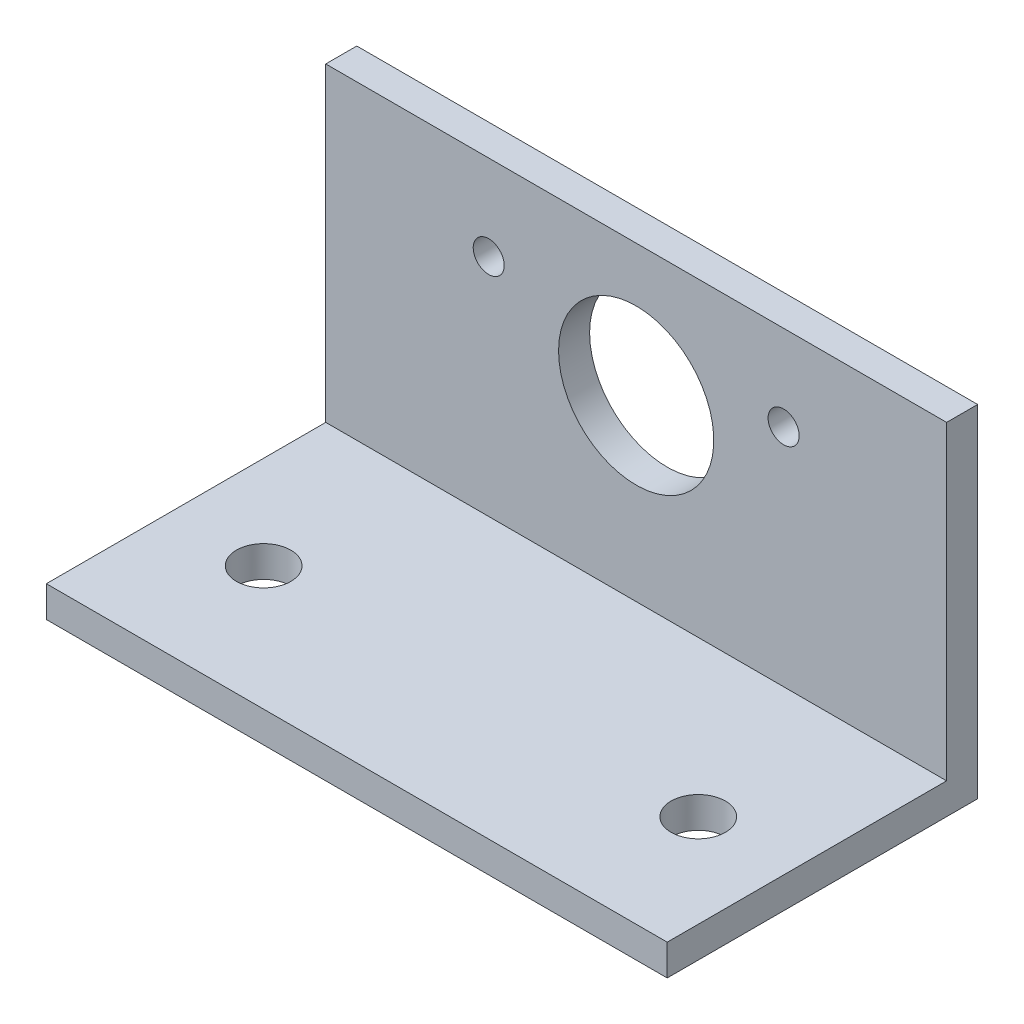
ISO-10303-21;
HEADER;
FILE_DESCRIPTION(('STEP AP214'),'2;1');
FILE_NAME('part.step','',(''),(''),'','','');
FILE_SCHEMA(('AUTOMOTIVE_DESIGN { 1 0 10303 214 1 1 1 1 }'));
ENDSEC;
DATA;
#1=APPLICATION_CONTEXT('core data for automotive mechanical design processes');
#2=APPLICATION_PROTOCOL_DEFINITION('international standard','automotive_design',2000,#1);
#3=PRODUCT_CONTEXT('',#1,'mechanical');
#4=PRODUCT('Part','Part','',(#3));
#5=PRODUCT_RELATED_PRODUCT_CATEGORY('part','',(#4));
#6=PRODUCT_DEFINITION_FORMATION('','',#4);
#7=PRODUCT_DEFINITION_CONTEXT('part definition',#1,'design');
#8=PRODUCT_DEFINITION('design','',#6,#7);
#9=PRODUCT_DEFINITION_SHAPE('','',#8);
#10=(LENGTH_UNIT() NAMED_UNIT(*) SI_UNIT(.MILLI.,.METRE.));
#11=(NAMED_UNIT(*) PLANE_ANGLE_UNIT() SI_UNIT($,.RADIAN.));
#12=(NAMED_UNIT(*) SI_UNIT($,.STERADIAN.) SOLID_ANGLE_UNIT());
#13=UNCERTAINTY_MEASURE_WITH_UNIT(LENGTH_MEASURE(1.E-05),#10,'distance_accuracy_value','');
#14=(GEOMETRIC_REPRESENTATION_CONTEXT(3) GLOBAL_UNCERTAINTY_ASSIGNED_CONTEXT((#13)) GLOBAL_UNIT_ASSIGNED_CONTEXT((#10,
#11,#12)) REPRESENTATION_CONTEXT('',''));
#15=CARTESIAN_POINT('',(0.,0.,0.));
#16=DIRECTION('',(0.,0.,1.));
#17=DIRECTION('',(1.,0.,0.));
#18=AXIS2_PLACEMENT_3D('',#15,#16,#17);
#19=CARTESIAN_POINT('',(20.,2.,-10.));
#20=DIRECTION('',(-1.,0.,0.));
#21=DIRECTION('',(0.,0.,1.));
#22=AXIS2_PLACEMENT_3D('',#19,#20,#21);
#23=PLANE('',#22);
#24=DIRECTION('',(0.,0.,-1.));
#25=VECTOR('',#24,1.);
#26=CARTESIAN_POINT('',(20.,0.,-10.));
#27=LINE('',#26,#25);
#28=CARTESIAN_POINT('',(20.,0.,10.));
#29=VERTEX_POINT('',#28);
#30=CARTESIAN_POINT('',(20.,0.,-10.));
#31=VERTEX_POINT('',#30);
#32=EDGE_CURVE('E102',#29,#31,#27,.T.);
#33=ORIENTED_EDGE('',*,*,#32,.T.);
#34=DIRECTION('',(0.,-1.,0.));
#35=VECTOR('',#34,1.);
#36=CARTESIAN_POINT('',(20.,2.,-10.));
#37=LINE('',#36,#35);
#38=CARTESIAN_POINT('',(20.,22.,-10.));
#39=VERTEX_POINT('',#38);
#40=EDGE_CURVE('E11',#39,#31,#37,.T.);
#41=ORIENTED_EDGE('',*,*,#40,.F.);
#42=DIRECTION('',(0.,0.,-1.));
#43=VECTOR('',#42,1.);
#44=CARTESIAN_POINT('',(20.,22.,-10.));
#45=LINE('',#44,#43);
#46=CARTESIAN_POINT('',(20.,22.,-8.));
#47=VERTEX_POINT('',#46);
#48=EDGE_CURVE('E168',#47,#39,#45,.T.);
#49=ORIENTED_EDGE('',*,*,#48,.F.);
#50=DIRECTION('',(0.,-1.,0.));
#51=VECTOR('',#50,1.);
#52=CARTESIAN_POINT('',(20.,22.,-8.));
#53=LINE('',#52,#51);
#54=CARTESIAN_POINT('',(20.,2.,-8.));
#55=VERTEX_POINT('',#54);
#56=EDGE_CURVE('E115',#47,#55,#53,.T.);
#57=ORIENTED_EDGE('',*,*,#56,.T.);
#58=DIRECTION('',(0.,0.,-1.));
#59=VECTOR('',#58,1.);
#60=CARTESIAN_POINT('',(20.,2.,-10.));
#61=LINE('',#60,#59);
#62=CARTESIAN_POINT('',(20.,2.,10.));
#63=VERTEX_POINT('',#62);
#64=EDGE_CURVE('E96',#63,#55,#61,.T.);
#65=ORIENTED_EDGE('',*,*,#64,.F.);
#66=DIRECTION('',(0.,-1.,0.));
#67=VECTOR('',#66,1.);
#68=CARTESIAN_POINT('',(20.,2.,10.));
#69=LINE('',#68,#67);
#70=EDGE_CURVE('E88',#63,#29,#69,.T.);
#71=ORIENTED_EDGE('',*,*,#70,.T.);
#72=EDGE_LOOP('',(#33,#41,#49,#57,#65,#71));
#73=FACE_BOUND('',#72,.T.);
#74=ADVANCED_FACE('F43',(#73),#23,.F.);
#75=CARTESIAN_POINT('',(-20.,2.,-10.));
#76=DIRECTION('',(0.,0.,1.));
#77=DIRECTION('',(1.,0.,0.));
#78=AXIS2_PLACEMENT_3D('',#75,#76,#77);
#79=PLANE('',#78);
#80=CARTESIAN_POINT('',(-9.5,16.5,-10.));
#81=DIRECTION('',(0.,0.,-1.));
#82=DIRECTION('',(-1.,0.,0.));
#83=AXIS2_PLACEMENT_3D('',#80,#81,#82);
#84=CIRCLE('',#83,1.);
#85=CARTESIAN_POINT('',(-10.5,16.5,-10.));
#86=VERTEX_POINT('',#85);
#87=EDGE_CURVE('E267',#86,#86,#84,.T.);
#88=ORIENTED_EDGE('',*,*,#87,.F.);
#89=EDGE_LOOP('',(#88));
#90=FACE_BOUND('',#89,.T.);
#91=CARTESIAN_POINT('',(9.5,16.5,-10.));
#92=DIRECTION('',(0.,0.,-1.));
#93=DIRECTION('',(-1.,0.,0.));
#94=AXIS2_PLACEMENT_3D('',#91,#92,#93);
#95=CIRCLE('',#94,1.);
#96=CARTESIAN_POINT('',(8.5,16.5,-10.));
#97=VERTEX_POINT('',#96);
#98=EDGE_CURVE('E265',#97,#97,#95,.T.);
#99=ORIENTED_EDGE('',*,*,#98,.F.);
#100=EDGE_LOOP('',(#99));
#101=FACE_BOUND('',#100,.T.);
#102=CARTESIAN_POINT('',(0.,13.5,-10.));
#103=DIRECTION('',(0.,0.,-1.));
#104=DIRECTION('',(-1.,0.,0.));
#105=AXIS2_PLACEMENT_3D('',#102,#103,#104);
#106=CIRCLE('',#105,5.);
#107=CARTESIAN_POINT('',(-5.,13.5,-10.));
#108=VERTEX_POINT('',#107);
#109=EDGE_CURVE('E131',#108,#108,#106,.T.);
#110=ORIENTED_EDGE('',*,*,#109,.F.);
#111=EDGE_LOOP('',(#110));
#112=FACE_BOUND('',#111,.T.);
#113=DIRECTION('',(-1.,0.,0.));
#114=VECTOR('',#113,1.);
#115=CARTESIAN_POINT('',(-20.,0.,-10.));
#116=LINE('',#115,#114);
#117=CARTESIAN_POINT('',(-20.,0.,-10.));
#118=VERTEX_POINT('',#117);
#119=EDGE_CURVE('E107',#31,#118,#116,.T.);
#120=ORIENTED_EDGE('',*,*,#119,.T.);
#121=DIRECTION('',(0.,-1.,0.));
#122=VECTOR('',#121,1.);
#123=CARTESIAN_POINT('',(-20.,2.,-10.));
#124=LINE('',#123,#122);
#125=CARTESIAN_POINT('',(-20.,22.,-10.));
#126=VERTEX_POINT('',#125);
#127=EDGE_CURVE('E52',#126,#118,#124,.T.);
#128=ORIENTED_EDGE('',*,*,#127,.F.);
#129=DIRECTION('',(-1.,0.,0.));
#130=VECTOR('',#129,1.);
#131=CARTESIAN_POINT('',(-20.,22.,-10.));
#132=LINE('',#131,#130);
#133=EDGE_CURVE('E172',#39,#126,#132,.T.);
#134=ORIENTED_EDGE('',*,*,#133,.F.);
#135=ORIENTED_EDGE('',*,*,#40,.T.);
#136=EDGE_LOOP('',(#120,#128,#134,#135));
#137=FACE_BOUND('',#136,.T.);
#138=ADVANCED_FACE('F192',(#90,#101,#112,#137),#79,.F.);
#139=CARTESIAN_POINT('',(-20.,2.,-10.));
#140=DIRECTION('',(1.,0.,0.));
#141=DIRECTION('',(0.,0.,-1.));
#142=AXIS2_PLACEMENT_3D('',#139,#140,#141);
#143=PLANE('',#142);
#144=DIRECTION('',(0.,0.,1.));
#145=VECTOR('',#144,1.);
#146=CARTESIAN_POINT('',(-20.,0.,-10.));
#147=LINE('',#146,#145);
#148=CARTESIAN_POINT('',(-20.,0.,10.));
#149=VERTEX_POINT('',#148);
#150=EDGE_CURVE('E97',#118,#149,#147,.T.);
#151=ORIENTED_EDGE('',*,*,#150,.T.);
#152=DIRECTION('',(0.,-1.,0.));
#153=VECTOR('',#152,1.);
#154=CARTESIAN_POINT('',(-20.,2.,10.));
#155=LINE('',#154,#153);
#156=CARTESIAN_POINT('',(-20.,2.,10.));
#157=VERTEX_POINT('',#156);
#158=EDGE_CURVE('E91',#157,#149,#155,.T.);
#159=ORIENTED_EDGE('',*,*,#158,.F.);
#160=DIRECTION('',(0.,0.,1.));
#161=VECTOR('',#160,1.);
#162=CARTESIAN_POINT('',(-20.,2.,-10.));
#163=LINE('',#162,#161);
#164=CARTESIAN_POINT('',(-20.,2.,-8.));
#165=VERTEX_POINT('',#164);
#166=EDGE_CURVE('E181',#165,#157,#163,.T.);
#167=ORIENTED_EDGE('',*,*,#166,.F.);
#168=DIRECTION('',(0.,-1.,0.));
#169=VECTOR('',#168,1.);
#170=CARTESIAN_POINT('',(-20.,22.,-8.));
#171=LINE('',#170,#169);
#172=CARTESIAN_POINT('',(-20.,22.,-8.));
#173=VERTEX_POINT('',#172);
#174=EDGE_CURVE('E109',#173,#165,#171,.T.);
#175=ORIENTED_EDGE('',*,*,#174,.F.);
#176=DIRECTION('',(0.,0.,1.));
#177=VECTOR('',#176,1.);
#178=CARTESIAN_POINT('',(-20.,22.,-10.));
#179=LINE('',#178,#177);
#180=EDGE_CURVE('E160',#126,#173,#179,.T.);
#181=ORIENTED_EDGE('',*,*,#180,.F.);
#182=ORIENTED_EDGE('',*,*,#127,.T.);
#183=EDGE_LOOP('',(#151,#159,#167,#175,#181,#182));
#184=FACE_BOUND('',#183,.T.);
#185=ADVANCED_FACE('F187',(#184),#143,.F.);
#186=CARTESIAN_POINT('',(-20.,2.,10.));
#187=DIRECTION('',(0.,0.,-1.));
#188=DIRECTION('',(-1.,0.,0.));
#189=AXIS2_PLACEMENT_3D('',#186,#187,#188);
#190=PLANE('',#189);
#191=DIRECTION('',(1.,0.,0.));
#192=VECTOR('',#191,1.);
#193=CARTESIAN_POINT('',(-20.,0.,10.));
#194=LINE('',#193,#192);
#195=EDGE_CURVE('E85',#149,#29,#194,.T.);
#196=ORIENTED_EDGE('',*,*,#195,.T.);
#197=ORIENTED_EDGE('',*,*,#70,.F.);
#198=DIRECTION('',(1.,0.,0.));
#199=VECTOR('',#198,1.);
#200=CARTESIAN_POINT('',(-20.,2.,10.));
#201=LINE('',#200,#199);
#202=EDGE_CURVE('E66',#157,#63,#201,.T.);
#203=ORIENTED_EDGE('',*,*,#202,.F.);
#204=ORIENTED_EDGE('',*,*,#158,.T.);
#205=EDGE_LOOP('',(#196,#197,#203,#204));
#206=FACE_BOUND('',#205,.T.);
#207=ADVANCED_FACE('F87',(#206),#190,.F.);
#208=CARTESIAN_POINT('',(0.,2.,0.));
#209=DIRECTION('',(0.,1.,0.));
#210=DIRECTION('',(0.,0.,1.));
#211=AXIS2_PLACEMENT_3D('',#208,#209,#210);
#212=PLANE('',#211);
#213=CARTESIAN_POINT('',(-14.,2.,2.));
#214=DIRECTION('',(0.,1.,0.));
#215=DIRECTION('',(0.,0.,1.));
#216=AXIS2_PLACEMENT_3D('',#213,#214,#215);
#217=CIRCLE('',#216,1.75);
#218=CARTESIAN_POINT('',(-14.,2.,3.75));
#219=VERTEX_POINT('',#218);
#220=EDGE_CURVE('E156',#219,#219,#217,.T.);
#221=ORIENTED_EDGE('',*,*,#220,.F.);
#222=EDGE_LOOP('',(#221));
#223=FACE_BOUND('',#222,.T.);
#224=CARTESIAN_POINT('',(14.,2.,2.));
#225=DIRECTION('',(0.,1.,0.));
#226=DIRECTION('',(0.,0.,1.));
#227=AXIS2_PLACEMENT_3D('',#224,#225,#226);
#228=CIRCLE('',#227,1.75);
#229=CARTESIAN_POINT('',(14.,2.,3.74999999999999));
#230=VERTEX_POINT('',#229);
#231=EDGE_CURVE('E149',#230,#230,#228,.T.);
#232=ORIENTED_EDGE('',*,*,#231,.F.);
#233=EDGE_LOOP('',(#232));
#234=FACE_BOUND('',#233,.T.);
#235=DIRECTION('',(1.,0.,0.));
#236=VECTOR('',#235,1.);
#237=CARTESIAN_POINT('',(-20.,2.,-8.));
#238=LINE('',#237,#236);
#239=EDGE_CURVE('E60',#165,#55,#238,.T.);
#240=ORIENTED_EDGE('',*,*,#239,.F.);
#241=ORIENTED_EDGE('',*,*,#166,.T.);
#242=ORIENTED_EDGE('',*,*,#202,.T.);
#243=ORIENTED_EDGE('',*,*,#64,.T.);
#244=EDGE_LOOP('',(#240,#241,#242,#243));
#245=FACE_BOUND('',#244,.T.);
#246=ADVANCED_FACE('F184',(#223,#234,#245),#212,.T.);
#247=CARTESIAN_POINT('',(0.,0.,0.));
#248=DIRECTION('',(0.,1.,0.));
#249=DIRECTION('',(0.,0.,1.));
#250=AXIS2_PLACEMENT_3D('',#247,#248,#249);
#251=PLANE('',#250);
#252=CARTESIAN_POINT('',(-14.,0.,2.));
#253=DIRECTION('',(0.,-1.,0.));
#254=DIRECTION('',(0.,0.,-1.));
#255=AXIS2_PLACEMENT_3D('',#252,#253,#254);
#256=CIRCLE('',#255,1.75);
#257=CARTESIAN_POINT('',(-14.,0.,0.249999999999997));
#258=VERTEX_POINT('',#257);
#259=EDGE_CURVE('E143',#258,#258,#256,.T.);
#260=ORIENTED_EDGE('',*,*,#259,.F.);
#261=EDGE_LOOP('',(#260));
#262=FACE_BOUND('',#261,.T.);
#263=CARTESIAN_POINT('',(14.,0.,2.));
#264=DIRECTION('',(0.,-1.,0.));
#265=DIRECTION('',(0.,0.,-1.));
#266=AXIS2_PLACEMENT_3D('',#263,#264,#265);
#267=CIRCLE('',#266,1.75);
#268=CARTESIAN_POINT('',(14.,0.,0.249999999999998));
#269=VERTEX_POINT('',#268);
#270=EDGE_CURVE('E138',#269,#269,#267,.T.);
#271=ORIENTED_EDGE('',*,*,#270,.F.);
#272=EDGE_LOOP('',(#271));
#273=FACE_BOUND('',#272,.T.);
#274=ORIENTED_EDGE('',*,*,#32,.F.);
#275=ORIENTED_EDGE('',*,*,#195,.F.);
#276=ORIENTED_EDGE('',*,*,#150,.F.);
#277=ORIENTED_EDGE('',*,*,#119,.F.);
#278=EDGE_LOOP('',(#274,#275,#276,#277));
#279=FACE_BOUND('',#278,.T.);
#280=ADVANCED_FACE('F106',(#262,#273,#279),#251,.F.);
#281=CARTESIAN_POINT('',(-20.,22.,-8.));
#282=DIRECTION('',(0.,0.,-1.));
#283=DIRECTION('',(-1.,0.,0.));
#284=AXIS2_PLACEMENT_3D('',#281,#282,#283);
#285=PLANE('',#284);
#286=CARTESIAN_POINT('',(-9.5,16.5,-8.00000000000001));
#287=DIRECTION('',(0.,0.,-1.));
#288=DIRECTION('',(-1.,0.,0.));
#289=AXIS2_PLACEMENT_3D('',#286,#287,#288);
#290=CIRCLE('',#289,1.);
#291=CARTESIAN_POINT('',(-10.5,16.5,-8.00000000000001));
#292=VERTEX_POINT('',#291);
#293=EDGE_CURVE('E46',#292,#292,#290,.T.);
#294=ORIENTED_EDGE('',*,*,#293,.T.);
#295=EDGE_LOOP('',(#294));
#296=FACE_BOUND('',#295,.T.);
#297=CARTESIAN_POINT('',(9.5,16.5,-8.00000000000001));
#298=DIRECTION('',(0.,0.,-1.));
#299=DIRECTION('',(-1.,0.,0.));
#300=AXIS2_PLACEMENT_3D('',#297,#298,#299);
#301=CIRCLE('',#300,1.);
#302=CARTESIAN_POINT('',(8.5,16.5,-8.00000000000001));
#303=VERTEX_POINT('',#302);
#304=EDGE_CURVE('E130',#303,#303,#301,.T.);
#305=ORIENTED_EDGE('',*,*,#304,.T.);
#306=EDGE_LOOP('',(#305));
#307=FACE_BOUND('',#306,.T.);
#308=CARTESIAN_POINT('',(0.,13.5,-8.00000000000001));
#309=DIRECTION('',(0.,0.,-1.));
#310=DIRECTION('',(-1.,0.,0.));
#311=AXIS2_PLACEMENT_3D('',#308,#309,#310);
#312=CIRCLE('',#311,5.);
#313=CARTESIAN_POINT('',(-5.,13.5,-8.00000000000001));
#314=VERTEX_POINT('',#313);
#315=EDGE_CURVE('E127',#314,#314,#312,.T.);
#316=ORIENTED_EDGE('',*,*,#315,.T.);
#317=EDGE_LOOP('',(#316));
#318=FACE_BOUND('',#317,.T.);
#319=ORIENTED_EDGE('',*,*,#239,.T.);
#320=ORIENTED_EDGE('',*,*,#56,.F.);
#321=DIRECTION('',(1.,0.,0.));
#322=VECTOR('',#321,1.);
#323=CARTESIAN_POINT('',(-20.,22.,-8.));
#324=LINE('',#323,#322);
#325=EDGE_CURVE('E164',#173,#47,#324,.T.);
#326=ORIENTED_EDGE('',*,*,#325,.F.);
#327=ORIENTED_EDGE('',*,*,#174,.T.);
#328=EDGE_LOOP('',(#319,#320,#326,#327));
#329=FACE_BOUND('',#328,.T.);
#330=ADVANCED_FACE('F207',(#296,#307,#318,#329),#285,.F.);
#331=CARTESIAN_POINT('',(0.,22.,0.));
#332=DIRECTION('',(0.,1.,0.));
#333=DIRECTION('',(0.,0.,1.));
#334=AXIS2_PLACEMENT_3D('',#331,#332,#333);
#335=PLANE('',#334);
#336=ORIENTED_EDGE('',*,*,#180,.T.);
#337=ORIENTED_EDGE('',*,*,#325,.T.);
#338=ORIENTED_EDGE('',*,*,#48,.T.);
#339=ORIENTED_EDGE('',*,*,#133,.T.);
#340=EDGE_LOOP('',(#336,#337,#338,#339));
#341=FACE_BOUND('',#340,.T.);
#342=ADVANCED_FACE('F196',(#341),#335,.T.);
#343=CARTESIAN_POINT('',(14.,22.,2.));
#344=DIRECTION('',(0.,-1.,0.));
#345=DIRECTION('',(0.,0.,-1.));
#346=AXIS2_PLACEMENT_3D('',#343,#344,#345);
#347=CYLINDRICAL_SURFACE('',#346,1.75);
#348=ORIENTED_EDGE('',*,*,#231,.T.);
#349=EDGE_LOOP('',(#348));
#350=FACE_BOUND('',#349,.T.);
#351=ORIENTED_EDGE('',*,*,#270,.T.);
#352=EDGE_LOOP('',(#351));
#353=FACE_BOUND('',#352,.T.);
#354=ADVANCED_FACE('F214',(#350,#353),#347,.F.);
#355=CARTESIAN_POINT('',(-14.,22.,2.));
#356=DIRECTION('',(0.,-1.,0.));
#357=DIRECTION('',(0.,0.,-1.));
#358=AXIS2_PLACEMENT_3D('',#355,#356,#357);
#359=CYLINDRICAL_SURFACE('',#358,1.75);
#360=ORIENTED_EDGE('',*,*,#220,.T.);
#361=EDGE_LOOP('',(#360));
#362=FACE_BOUND('',#361,.T.);
#363=ORIENTED_EDGE('',*,*,#259,.T.);
#364=EDGE_LOOP('',(#363));
#365=FACE_BOUND('',#364,.T.);
#366=ADVANCED_FACE('F241',(#362,#365),#359,.F.);
#367=CARTESIAN_POINT('',(0.,13.5,10.));
#368=DIRECTION('',(0.,0.,-1.));
#369=DIRECTION('',(-1.,0.,0.));
#370=AXIS2_PLACEMENT_3D('',#367,#368,#369);
#371=CYLINDRICAL_SURFACE('',#370,5.);
#372=ORIENTED_EDGE('',*,*,#109,.T.);
#373=EDGE_LOOP('',(#372));
#374=FACE_BOUND('',#373,.T.);
#375=ORIENTED_EDGE('',*,*,#315,.F.);
#376=EDGE_LOOP('',(#375));
#377=FACE_BOUND('',#376,.T.);
#378=ADVANCED_FACE('F246',(#374,#377),#371,.F.);
#379=CARTESIAN_POINT('',(9.5,16.5,10.));
#380=DIRECTION('',(0.,0.,-1.));
#381=DIRECTION('',(-1.,0.,0.));
#382=AXIS2_PLACEMENT_3D('',#379,#380,#381);
#383=CYLINDRICAL_SURFACE('',#382,1.);
#384=ORIENTED_EDGE('',*,*,#98,.T.);
#385=EDGE_LOOP('',(#384));
#386=FACE_BOUND('',#385,.T.);
#387=ORIENTED_EDGE('',*,*,#304,.F.);
#388=EDGE_LOOP('',(#387));
#389=FACE_BOUND('',#388,.T.);
#390=ADVANCED_FACE('F252',(#386,#389),#383,.F.);
#391=CARTESIAN_POINT('',(-9.5,16.5,10.));
#392=DIRECTION('',(0.,0.,-1.));
#393=DIRECTION('',(-1.,0.,0.));
#394=AXIS2_PLACEMENT_3D('',#391,#392,#393);
#395=CYLINDRICAL_SURFACE('',#394,1.);
#396=ORIENTED_EDGE('',*,*,#87,.T.);
#397=EDGE_LOOP('',(#396));
#398=FACE_BOUND('',#397,.T.);
#399=ORIENTED_EDGE('',*,*,#293,.F.);
#400=EDGE_LOOP('',(#399));
#401=FACE_BOUND('',#400,.T.);
#402=ADVANCED_FACE('F254',(#398,#401),#395,.F.);
#403=CLOSED_SHELL('',(#74,#138,#185,#207,#246,#280,#330,#342,#354,#366,#378,#390,#402));
#404=MANIFOLD_SOLID_BREP('B2',#403);
#405=ADVANCED_BREP_SHAPE_REPRESENTATION('',(#18,#404),#14);
#406=SHAPE_DEFINITION_REPRESENTATION(#9,#405);
ENDSEC;
END-ISO-10303-21;
